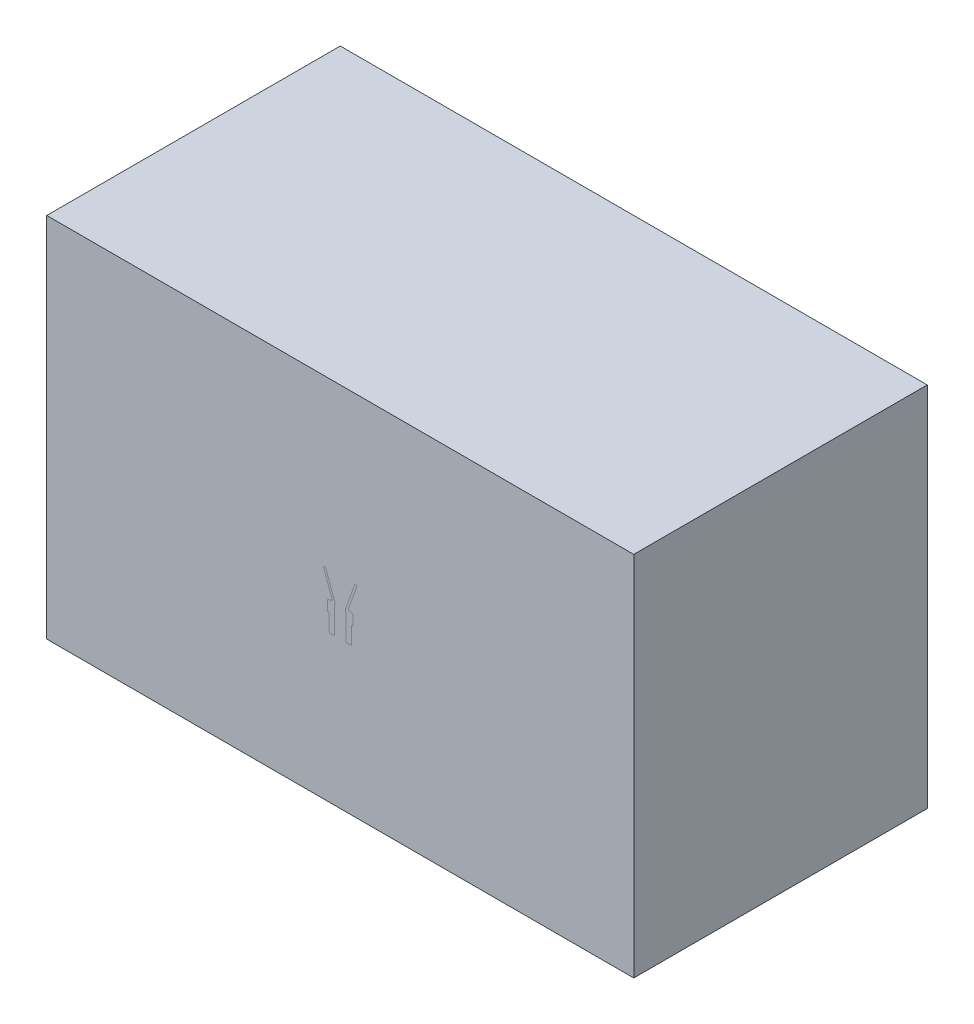
ISO-10303-21;
HEADER;
FILE_DESCRIPTION(('STEP AP214'),'2;1');
FILE_NAME('part.step','',(''),(''),'','','');
FILE_SCHEMA(('AUTOMOTIVE_DESIGN { 1 0 10303 214 1 1 1 1 }'));
ENDSEC;
DATA;
#1=APPLICATION_CONTEXT('core data for automotive mechanical design processes');
#2=APPLICATION_PROTOCOL_DEFINITION('international standard','automotive_design',2000,#1);
#3=PRODUCT_CONTEXT('',#1,'mechanical');
#4=PRODUCT('Part','Part','',(#3));
#5=PRODUCT_RELATED_PRODUCT_CATEGORY('part','',(#4));
#6=PRODUCT_DEFINITION_FORMATION('','',#4);
#7=PRODUCT_DEFINITION_CONTEXT('part definition',#1,'design');
#8=PRODUCT_DEFINITION('design','',#6,#7);
#9=PRODUCT_DEFINITION_SHAPE('','',#8);
#10=(LENGTH_UNIT() NAMED_UNIT(*) SI_UNIT(.MILLI.,.METRE.));
#11=(NAMED_UNIT(*) PLANE_ANGLE_UNIT() SI_UNIT($,.RADIAN.));
#12=(NAMED_UNIT(*) SI_UNIT($,.STERADIAN.) SOLID_ANGLE_UNIT());
#13=UNCERTAINTY_MEASURE_WITH_UNIT(LENGTH_MEASURE(1.E-05),#10,'distance_accuracy_value','');
#14=(GEOMETRIC_REPRESENTATION_CONTEXT(3) GLOBAL_UNCERTAINTY_ASSIGNED_CONTEXT((#13)) GLOBAL_UNIT_ASSIGNED_CONTEXT((#10,
#11,#12)) REPRESENTATION_CONTEXT('',''));
#15=CARTESIAN_POINT('',(0.,0.,0.));
#16=DIRECTION('',(0.,0.,1.));
#17=DIRECTION('',(1.,0.,0.));
#18=AXIS2_PLACEMENT_3D('',#15,#16,#17);
#19=CARTESIAN_POINT('',(0.,941.954291822987,0.));
#20=DIRECTION('',(0.,1.,0.));
#21=DIRECTION('',(0.,0.,1.));
#22=AXIS2_PLACEMENT_3D('',#19,#20,#21);
#23=TOROIDAL_SURFACE('',#22,265.023984913654,12.7);
#24=CARTESIAN_POINT('',(0.,946.297947643223,0.));
#25=DIRECTION('',(0.,-1.,0.));
#26=DIRECTION('',(0.,0.,-1.));
#27=AXIS2_PLACEMENT_3D('',#24,#25,#26);
#28=CIRCLE('',#27,253.089888629673);
#29=CARTESIAN_POINT('',(253.089888629673,946.297947643223,0.));
#30=VERTEX_POINT('',#29);
#31=CARTESIAN_POINT('',(-253.089888629673,946.297947643223,0.));
#32=VERTEX_POINT('',#31);
#33=EDGE_CURVE('E175',#30,#32,#28,.F.);
#34=ORIENTED_EDGE('',*,*,#33,.F.);
#35=CARTESIAN_POINT('',(265.023984913654,941.954291822987,0.));
#36=DIRECTION('',(0.,0.,1.));
#37=DIRECTION('',(1.,0.,0.));
#38=AXIS2_PLACEMENT_3D('',#35,#36,#37);
#39=CIRCLE('',#38,12.7);
#40=CARTESIAN_POINT('',(269.36764073389,953.888388106968,0.));
#41=VERTEX_POINT('',#40);
#42=EDGE_CURVE('E214',#30,#41,#39,.F.);
#43=ORIENTED_EDGE('',*,*,#42,.T.);
#44=CARTESIAN_POINT('',(0.,953.888388106968,0.));
#45=DIRECTION('',(0.,1.,0.));
#46=DIRECTION('',(0.,0.,1.));
#47=AXIS2_PLACEMENT_3D('',#44,#45,#46);
#48=CIRCLE('',#47,269.36764073389);
#49=CARTESIAN_POINT('',(-269.36764073389,953.888388106968,0.));
#50=VERTEX_POINT('',#49);
#51=EDGE_CURVE('E169',#50,#41,#48,.F.);
#52=ORIENTED_EDGE('',*,*,#51,.F.);
#53=CARTESIAN_POINT('',(-265.023984913654,941.954291822987,0.));
#54=DIRECTION('',(0.,0.,1.));
#55=DIRECTION('',(1.,0.,0.));
#56=AXIS2_PLACEMENT_3D('',#53,#54,#55);
#57=CIRCLE('',#56,12.7);
#58=EDGE_CURVE('E177',#50,#32,#57,.F.);
#59=ORIENTED_EDGE('',*,*,#58,.T.);
#60=EDGE_LOOP('',(#34,#43,#52,#59));
#61=FACE_BOUND('',#60,.T.);
#62=ADVANCED_FACE('F53',(#61),#23,.T.);
#63=CARTESIAN_POINT('',(0.,937.610636002752,0.));
#64=DIRECTION('',(0.,1.,0.));
#65=DIRECTION('',(0.,0.,1.));
#66=AXIS2_PLACEMENT_3D('',#63,#64,#65);
#67=TOROIDAL_SURFACE('',#66,276.958081197635,12.7);
#68=CARTESIAN_POINT('',(0.,949.544732286733,0.));
#69=DIRECTION('',(0.,1.,0.));
#70=DIRECTION('',(0.,0.,1.));
#71=AXIS2_PLACEMENT_3D('',#68,#69,#70);
#72=CIRCLE('',#71,281.301737017871);
#73=CARTESIAN_POINT('',(281.301737017871,949.544732286733,0.));
#74=VERTEX_POINT('',#73);
#75=CARTESIAN_POINT('',(-281.301737017871,949.544732286733,0.));
#76=VERTEX_POINT('',#75);
#77=EDGE_CURVE('E172',#74,#76,#72,.T.);
#78=ORIENTED_EDGE('',*,*,#77,.F.);
#79=CARTESIAN_POINT('',(276.958081197635,937.610636002752,0.));
#80=DIRECTION('',(0.,0.,1.));
#81=DIRECTION('',(1.,0.,0.));
#82=AXIS2_PLACEMENT_3D('',#79,#80,#81);
#83=CIRCLE('',#82,12.7);
#84=CARTESIAN_POINT('',(288.892177481616,933.266980182516,0.));
#85=VERTEX_POINT('',#84);
#86=EDGE_CURVE('E242',#74,#85,#83,.F.);
#87=ORIENTED_EDGE('',*,*,#86,.T.);
#88=CARTESIAN_POINT('',(0.,933.266980182516,0.));
#89=DIRECTION('',(0.,-1.,0.));
#90=DIRECTION('',(0.,0.,-1.));
#91=AXIS2_PLACEMENT_3D('',#88,#89,#90);
#92=CIRCLE('',#91,288.892177481616);
#93=CARTESIAN_POINT('',(-288.892177481616,933.266980182516,0.));
#94=VERTEX_POINT('',#93);
#95=EDGE_CURVE('E163',#94,#85,#92,.T.);
#96=ORIENTED_EDGE('',*,*,#95,.F.);
#97=CARTESIAN_POINT('',(-276.958081197635,937.610636002752,0.));
#98=DIRECTION('',(0.,0.,1.));
#99=DIRECTION('',(1.,0.,0.));
#100=AXIS2_PLACEMENT_3D('',#97,#98,#99);
#101=CIRCLE('',#100,12.7);
#102=EDGE_CURVE('E226',#94,#76,#101,.F.);
#103=ORIENTED_EDGE('',*,*,#102,.T.);
#104=EDGE_LOOP('',(#78,#87,#96,#103));
#105=FACE_BOUND('',#104,.T.);
#106=ADVANCED_FACE('F235',(#105),#67,.T.);
#107=CARTESIAN_POINT('',(0.,483.381827876511,0.));
#108=DIRECTION('',(0.,-1.,0.));
#109=DIRECTION('',(0.,0.,-1.));
#110=AXIS2_PLACEMENT_3D('',#107,#108,#109);
#111=TOROIDAL_SURFACE('',#110,138.66243091436,50.8);
#112=CARTESIAN_POINT('',(0.,500.756451157454,0.));
#113=DIRECTION('',(0.,-1.,0.));
#114=DIRECTION('',(0.,0.,-1.));
#115=AXIS2_PLACEMENT_3D('',#112,#113,#114);
#116=CIRCLE('',#115,90.9260457784361);
#117=CARTESIAN_POINT('',(-90.9260457784361,500.756451157454,0.));
#118=VERTEX_POINT('',#117);
#119=CARTESIAN_POINT('',(90.9260457784361,500.756451157454,0.));
#120=VERTEX_POINT('',#119);
#121=EDGE_CURVE('E158',#118,#120,#116,.T.);
#122=ORIENTED_EDGE('',*,*,#121,.F.);
#123=CARTESIAN_POINT('',(-138.66243091436,483.381827876511,0.));
#124=DIRECTION('',(0.,0.,1.));
#125=DIRECTION('',(1.,0.,0.));
#126=AXIS2_PLACEMENT_3D('',#123,#124,#125);
#127=CIRCLE('',#126,50.8);
#128=CARTESIAN_POINT('',(-95.25,457.,0.));
#129=VERTEX_POINT('',#128);
#130=EDGE_CURVE('E224',#118,#129,#127,.F.);
#131=ORIENTED_EDGE('',*,*,#130,.T.);
#132=CARTESIAN_POINT('',(0.,457.,0.));
#133=DIRECTION('',(0.,1.,0.));
#134=DIRECTION('',(0.,0.,1.));
#135=AXIS2_PLACEMENT_3D('',#132,#133,#134);
#136=CIRCLE('',#135,95.25);
#137=CARTESIAN_POINT('',(95.25,457.,0.));
#138=VERTEX_POINT('',#137);
#139=EDGE_CURVE('E197',#138,#129,#136,.T.);
#140=ORIENTED_EDGE('',*,*,#139,.F.);
#141=CARTESIAN_POINT('',(138.66243091436,483.381827876511,0.));
#142=DIRECTION('',(0.,0.,1.));
#143=DIRECTION('',(1.,0.,0.));
#144=AXIS2_PLACEMENT_3D('',#141,#142,#143);
#145=CIRCLE('',#144,50.8);
#146=EDGE_CURVE('E244',#138,#120,#145,.F.);
#147=ORIENTED_EDGE('',*,*,#146,.T.);
#148=EDGE_LOOP('',(#122,#131,#140,#147));
#149=FACE_BOUND('',#148,.T.);
#150=ADVANCED_FACE('F281',(#149),#111,.T.);
#151=CARTESIAN_POINT('',(0.,457.,0.));
#152=DIRECTION('',(0.,1.,0.));
#153=DIRECTION('',(0.,0.,1.));
#154=AXIS2_PLACEMENT_3D('',#151,#152,#153);
#155=CONICAL_SURFACE('',#154,75.,0.349065850398861);
#156=DIRECTION('',(0.342020143325664,0.93969262078591,0.));
#157=VECTOR('',#156,1.);
#158=CARTESIAN_POINT('',(0.,250.9391935409,0.));
#159=LINE('',#158,#157);
#160=EDGE_CURVE('E241',#30,#120,#159,.F.);
#161=ORIENTED_EDGE('',*,*,#160,.F.);
#162=ORIENTED_EDGE('',*,*,#33,.T.);
#163=DIRECTION('',(0.342020143325664,-0.93969262078591,0.));
#164=VECTOR('',#163,1.);
#165=CARTESIAN_POINT('',(0.,250.9391935409,0.));
#166=LINE('',#165,#164);
#167=EDGE_CURVE('E183',#118,#32,#166,.F.);
#168=ORIENTED_EDGE('',*,*,#167,.F.);
#169=ORIENTED_EDGE('',*,*,#121,.T.);
#170=EDGE_LOOP('',(#161,#162,#168,#169));
#171=FACE_BOUND('',#170,.T.);
#172=ADVANCED_FACE('F273',(#171),#155,.F.);
#173=CARTESIAN_POINT('',(0.,958.232043927204,0.));
#174=DIRECTION('',(0.,-1.,0.));
#175=DIRECTION('',(0.,0.,-1.));
#176=AXIS2_PLACEMENT_3D('',#173,#174,#175);
#177=CONICAL_SURFACE('',#176,257.433544449909,1.22173047639604);
#178=DIRECTION('',(-0.93969262078591,-0.342020143325664,0.));
#179=VECTOR('',#178,1.);
#180=CARTESIAN_POINT('',(0.,1051.93019140862,0.));
#181=LINE('',#180,#179);
#182=EDGE_CURVE('E187',#50,#76,#181,.T.);
#183=ORIENTED_EDGE('',*,*,#182,.F.);
#184=ORIENTED_EDGE('',*,*,#51,.T.);
#185=DIRECTION('',(-0.93969262078591,0.342020143325664,0.));
#186=VECTOR('',#185,1.);
#187=CARTESIAN_POINT('',(0.,1051.93019140862,0.));
#188=LINE('',#187,#186);
#189=EDGE_CURVE('E239',#74,#41,#188,.T.);
#190=ORIENTED_EDGE('',*,*,#189,.F.);
#191=ORIENTED_EDGE('',*,*,#77,.T.);
#192=EDGE_LOOP('',(#183,#184,#190,#191));
#193=FACE_BOUND('',#192,.T.);
#194=ADVANCED_FACE('F238',(#193),#177,.T.);
#195=CARTESIAN_POINT('',(0.,945.201076466497,0.));
#196=DIRECTION('',(0.,1.,0.));
#197=DIRECTION('',(0.,0.,1.));
#198=AXIS2_PLACEMENT_3D('',#195,#196,#197);
#199=CONICAL_SURFACE('',#198,293.235833301852,0.34906585039886);
#200=DIRECTION('',(0.342020143325663,0.93969262078591,0.));
#201=VECTOR('',#200,1.);
#202=CARTESIAN_POINT('',(0.,139.542245894684,0.));
#203=LINE('',#202,#201);
#204=CARTESIAN_POINT('',(136.003504924822,513.208804642325,0.));
#205=VERTEX_POINT('',#204);
#206=EDGE_CURVE('E249',#205,#85,#203,.T.);
#207=ORIENTED_EDGE('',*,*,#206,.F.);
#208=CARTESIAN_POINT('',(0.,513.208804642325,0.));
#209=DIRECTION('',(0.,-1.,0.));
#210=DIRECTION('',(0.,0.,-1.));
#211=AXIS2_PLACEMENT_3D('',#208,#209,#210);
#212=CIRCLE('',#211,136.003504924822);
#213=CARTESIAN_POINT('',(-136.003504924822,513.208804642325,0.));
#214=VERTEX_POINT('',#213);
#215=EDGE_CURVE('E146',#214,#205,#212,.T.);
#216=ORIENTED_EDGE('',*,*,#215,.F.);
#217=DIRECTION('',(0.342020143325663,-0.93969262078591,0.));
#218=VECTOR('',#217,1.);
#219=CARTESIAN_POINT('',(0.,139.542245894684,0.));
#220=LINE('',#219,#218);
#221=EDGE_CURVE('E222',#94,#214,#220,.T.);
#222=ORIENTED_EDGE('',*,*,#221,.F.);
#223=ORIENTED_EDGE('',*,*,#95,.T.);
#224=EDGE_LOOP('',(#207,#216,#222,#223));
#225=FACE_BOUND('',#224,.T.);
#226=ADVANCED_FACE('F265',(#225),#199,.T.);
#227=CARTESIAN_POINT('',(0.,513.208804642325,0.));
#228=DIRECTION('',(0.,-1.,0.));
#229=DIRECTION('',(0.,0.,-1.));
#230=AXIS2_PLACEMENT_3D('',#227,#228,#229);
#231=CONICAL_SURFACE('',#230,136.003504924822,1.22173047639604);
#232=DIRECTION('',(-0.93969262078591,-0.342020143325664,0.));
#233=VECTOR('',#232,1.);
#234=CARTESIAN_POINT('',(0.,562.710032190836,0.));
#235=LINE('',#234,#233);
#236=CARTESIAN_POINT('',(-220.65,482.4,0.));
#237=VERTEX_POINT('',#236);
#238=EDGE_CURVE('E220',#214,#237,#235,.T.);
#239=ORIENTED_EDGE('',*,*,#238,.F.);
#240=ORIENTED_EDGE('',*,*,#215,.T.);
#241=DIRECTION('',(-0.93969262078591,0.342020143325664,0.));
#242=VECTOR('',#241,1.);
#243=CARTESIAN_POINT('',(0.,562.710032190836,0.));
#244=LINE('',#243,#242);
#245=CARTESIAN_POINT('',(220.65,482.4,0.));
#246=VERTEX_POINT('',#245);
#247=EDGE_CURVE('E251',#246,#205,#244,.T.);
#248=ORIENTED_EDGE('',*,*,#247,.F.);
#249=CARTESIAN_POINT('',(0.,482.4,0.));
#250=DIRECTION('',(0.,-1.,0.));
#251=DIRECTION('',(0.,0.,-1.));
#252=AXIS2_PLACEMENT_3D('',#249,#250,#251);
#253=CIRCLE('',#252,220.65);
#254=EDGE_CURVE('E193',#237,#246,#253,.T.);
#255=ORIENTED_EDGE('',*,*,#254,.F.);
#256=EDGE_LOOP('',(#239,#240,#248,#255));
#257=FACE_BOUND('',#256,.T.);
#258=ADVANCED_FACE('F260',(#257),#231,.T.);
#259=CARTESIAN_POINT('',(0.,0.,0.));
#260=DIRECTION('',(0.,-1.,0.));
#261=DIRECTION('',(0.,0.,-1.));
#262=AXIS2_PLACEMENT_3D('',#259,#260,#261);
#263=CYLINDRICAL_SURFACE('',#262,220.65);
#264=DIRECTION('',(0.,-1.,0.));
#265=VECTOR('',#264,1.);
#266=CARTESIAN_POINT('',(-220.65,0.,0.));
#267=LINE('',#266,#265);
#268=CARTESIAN_POINT('',(-220.65,307.,0.));
#269=VERTEX_POINT('',#268);
#270=EDGE_CURVE('E213',#237,#269,#267,.T.);
#271=ORIENTED_EDGE('',*,*,#270,.F.);
#272=ORIENTED_EDGE('',*,*,#254,.T.);
#273=DIRECTION('',(0.,-1.,0.));
#274=VECTOR('',#273,1.);
#275=CARTESIAN_POINT('',(220.65,0.,0.));
#276=LINE('',#275,#274);
#277=CARTESIAN_POINT('',(220.65,307.,0.));
#278=VERTEX_POINT('',#277);
#279=EDGE_CURVE('E153',#278,#246,#276,.F.);
#280=ORIENTED_EDGE('',*,*,#279,.F.);
#281=CARTESIAN_POINT('',(0.,307.,0.));
#282=DIRECTION('',(0.,-1.,0.));
#283=DIRECTION('',(0.,0.,-1.));
#284=AXIS2_PLACEMENT_3D('',#281,#282,#283);
#285=CIRCLE('',#284,220.65);
#286=EDGE_CURVE('E152',#269,#278,#285,.T.);
#287=ORIENTED_EDGE('',*,*,#286,.F.);
#288=EDGE_LOOP('',(#271,#272,#280,#287));
#289=FACE_BOUND('',#288,.T.);
#290=ADVANCED_FACE('F263',(#289),#263,.T.);
#291=CARTESIAN_POINT('',(-195.25,307.,0.));
#292=DIRECTION('',(0.,1.,0.));
#293=DIRECTION('',(0.,0.,1.));
#294=AXIS2_PLACEMENT_3D('',#291,#292,#293);
#295=PLANE('',#294);
#296=DIRECTION('',(1.,0.,0.));
#297=VECTOR('',#296,1.);
#298=CARTESIAN_POINT('',(-195.25,307.,0.));
#299=LINE('',#298,#297);
#300=CARTESIAN_POINT('',(-195.25,307.,0.));
#301=VERTEX_POINT('',#300);
#302=EDGE_CURVE('E75',#269,#301,#299,.T.);
#303=ORIENTED_EDGE('',*,*,#302,.F.);
#304=ORIENTED_EDGE('',*,*,#286,.T.);
#305=CARTESIAN_POINT('',(195.25,307.,0.));
#306=VERTEX_POINT('',#305);
#307=EDGE_CURVE('E140',#306,#278,#299,.T.);
#308=ORIENTED_EDGE('',*,*,#307,.F.);
#309=CARTESIAN_POINT('',(0.,307.,0.));
#310=DIRECTION('',(0.,1.,0.));
#311=DIRECTION('',(0.,0.,1.));
#312=AXIS2_PLACEMENT_3D('',#309,#310,#311);
#313=CIRCLE('',#312,195.25);
#314=EDGE_CURVE('E150',#306,#301,#313,.T.);
#315=ORIENTED_EDGE('',*,*,#314,.T.);
#316=EDGE_LOOP('',(#303,#304,#308,#315));
#317=FACE_BOUND('',#316,.T.);
#318=ADVANCED_FACE('F55',(#317),#295,.F.);
#319=CARTESIAN_POINT('',(0.,457.,0.));
#320=DIRECTION('',(0.,-1.,0.));
#321=DIRECTION('',(0.,0.,-1.));
#322=AXIS2_PLACEMENT_3D('',#319,#320,#321);
#323=CYLINDRICAL_SURFACE('',#322,95.25);
#324=ORIENTED_EDGE('',*,*,#139,.T.);
#325=DIRECTION('',(0.,-1.,0.));
#326=VECTOR('',#325,1.);
#327=CARTESIAN_POINT('',(-95.25,457.,0.));
#328=LINE('',#327,#326);
#329=CARTESIAN_POINT('',(-95.25,0.,0.));
#330=VERTEX_POINT('',#329);
#331=EDGE_CURVE('E210',#129,#330,#328,.T.);
#332=ORIENTED_EDGE('',*,*,#331,.T.);
#333=CARTESIAN_POINT('',(0.,0.,0.));
#334=DIRECTION('',(0.,1.,0.));
#335=DIRECTION('',(0.,0.,1.));
#336=AXIS2_PLACEMENT_3D('',#333,#334,#335);
#337=CIRCLE('',#336,95.25);
#338=CARTESIAN_POINT('',(95.25,0.,0.));
#339=VERTEX_POINT('',#338);
#340=EDGE_CURVE('E160',#339,#330,#337,.T.);
#341=ORIENTED_EDGE('',*,*,#340,.F.);
#342=DIRECTION('',(0.,-1.,0.));
#343=VECTOR('',#342,1.);
#344=CARTESIAN_POINT('',(95.25,457.,0.));
#345=LINE('',#344,#343);
#346=EDGE_CURVE('E154',#339,#138,#345,.F.);
#347=ORIENTED_EDGE('',*,*,#346,.T.);
#348=EDGE_LOOP('',(#324,#332,#341,#347));
#349=FACE_BOUND('',#348,.T.);
#350=ADVANCED_FACE('F208',(#349),#323,.F.);
#351=CARTESIAN_POINT('',(0.,0.,0.));
#352=DIRECTION('',(0.,1.,0.));
#353=DIRECTION('',(0.,0.,1.));
#354=AXIS2_PLACEMENT_3D('',#351,#352,#353);
#355=PLANE('',#354);
#356=DIRECTION('',(1.,0.,0.));
#357=VECTOR('',#356,1.);
#358=CARTESIAN_POINT('',(0.,0.,0.));
#359=LINE('',#358,#357);
#360=CARTESIAN_POINT('',(-195.25,0.,0.));
#361=VERTEX_POINT('',#360);
#362=EDGE_CURVE('E204',#361,#330,#359,.T.);
#363=ORIENTED_EDGE('',*,*,#362,.F.);
#364=CARTESIAN_POINT('',(0.,0.,0.));
#365=DIRECTION('',(0.,1.,0.));
#366=DIRECTION('',(0.,0.,1.));
#367=AXIS2_PLACEMENT_3D('',#364,#365,#366);
#368=CIRCLE('',#367,195.25);
#369=CARTESIAN_POINT('',(195.25,0.,0.));
#370=VERTEX_POINT('',#369);
#371=EDGE_CURVE('E157',#370,#361,#368,.T.);
#372=ORIENTED_EDGE('',*,*,#371,.F.);
#373=EDGE_CURVE('E68',#339,#370,#359,.T.);
#374=ORIENTED_EDGE('',*,*,#373,.F.);
#375=ORIENTED_EDGE('',*,*,#340,.T.);
#376=EDGE_LOOP('',(#363,#372,#374,#375));
#377=FACE_BOUND('',#376,.T.);
#378=ADVANCED_FACE('F203',(#377),#355,.F.);
#379=CARTESIAN_POINT('',(0.,457.,0.));
#380=DIRECTION('',(0.,-1.,0.));
#381=DIRECTION('',(0.,0.,-1.));
#382=AXIS2_PLACEMENT_3D('',#379,#380,#381);
#383=CYLINDRICAL_SURFACE('',#382,195.25);
#384=DIRECTION('',(0.,-1.,0.));
#385=VECTOR('',#384,1.);
#386=CARTESIAN_POINT('',(-195.25,457.,0.));
#387=LINE('',#386,#385);
#388=EDGE_CURVE('E12',#301,#361,#387,.T.);
#389=ORIENTED_EDGE('',*,*,#388,.F.);
#390=ORIENTED_EDGE('',*,*,#314,.F.);
#391=DIRECTION('',(0.,-1.,0.));
#392=VECTOR('',#391,1.);
#393=CARTESIAN_POINT('',(195.25,457.,0.));
#394=LINE('',#393,#392);
#395=EDGE_CURVE('E61',#370,#306,#394,.F.);
#396=ORIENTED_EDGE('',*,*,#395,.F.);
#397=ORIENTED_EDGE('',*,*,#371,.T.);
#398=EDGE_LOOP('',(#389,#390,#396,#397));
#399=FACE_BOUND('',#398,.T.);
#400=ADVANCED_FACE('F156',(#399),#383,.T.);
#401=CARTESIAN_POINT('',(0.,0.,0.));
#402=DIRECTION('',(0.,0.,1.));
#403=DIRECTION('',(1.,0.,0.));
#404=AXIS2_PLACEMENT_3D('',#401,#402,#403);
#405=PLANE('',#404);
#406=ORIENTED_EDGE('',*,*,#160,.T.);
#407=ORIENTED_EDGE('',*,*,#146,.F.);
#408=ORIENTED_EDGE('',*,*,#346,.F.);
#409=ORIENTED_EDGE('',*,*,#373,.T.);
#410=ORIENTED_EDGE('',*,*,#395,.T.);
#411=ORIENTED_EDGE('',*,*,#307,.T.);
#412=ORIENTED_EDGE('',*,*,#279,.T.);
#413=ORIENTED_EDGE('',*,*,#247,.T.);
#414=ORIENTED_EDGE('',*,*,#206,.T.);
#415=ORIENTED_EDGE('',*,*,#86,.F.);
#416=ORIENTED_EDGE('',*,*,#189,.T.);
#417=ORIENTED_EDGE('',*,*,#42,.F.);
#418=EDGE_LOOP('',(#406,#407,#408,#409,#410,#411,#412,#413,#414,#415,#416,#417));
#419=FACE_BOUND('',#418,.T.);
#420=ADVANCED_FACE('F139',(#419),#405,.T.);
#421=ORIENTED_EDGE('',*,*,#182,.T.);
#422=ORIENTED_EDGE('',*,*,#102,.F.);
#423=ORIENTED_EDGE('',*,*,#221,.T.);
#424=ORIENTED_EDGE('',*,*,#238,.T.);
#425=ORIENTED_EDGE('',*,*,#270,.T.);
#426=ORIENTED_EDGE('',*,*,#302,.T.);
#427=ORIENTED_EDGE('',*,*,#388,.T.);
#428=ORIENTED_EDGE('',*,*,#362,.T.);
#429=ORIENTED_EDGE('',*,*,#331,.F.);
#430=ORIENTED_EDGE('',*,*,#130,.F.);
#431=ORIENTED_EDGE('',*,*,#167,.T.);
#432=ORIENTED_EDGE('',*,*,#58,.F.);
#433=EDGE_LOOP('',(#421,#422,#423,#424,#425,#426,#427,#428,#429,#430,#431,#432));
#434=FACE_BOUND('',#433,.T.);
#435=ADVANCED_FACE('F229',(#434),#405,.T.);
#436=CLOSED_SHELL('',(#62,#106,#150,#172,#194,#226,#258,#290,#318,#350,#378,#400,#420,#435));
#437=MANIFOLD_SOLID_BREP('B2',#436);
#438=CARTESIAN_POINT('',(0.,941.954291822987,0.));
#439=DIRECTION('',(0.,1.,0.));
#440=DIRECTION('',(0.,0.,1.));
#441=AXIS2_PLACEMENT_3D('',#438,#439,#440);
#442=TOROIDAL_SURFACE('',#441,265.023984913654,12.7);
#443=CARTESIAN_POINT('',(265.023984913654,941.954291822987,0.));
#444=DIRECTION('',(0.,0.,1.));
#445=DIRECTION('',(1.,0.,0.));
#446=AXIS2_PLACEMENT_3D('',#443,#444,#445);
#447=CIRCLE('',#446,12.7);
#448=CARTESIAN_POINT('',(253.089888629673,946.297947643223,0.));
#449=VERTEX_POINT('',#448);
#450=CARTESIAN_POINT('',(269.36764073389,953.888388106968,0.));
#451=VERTEX_POINT('',#450);
#452=EDGE_CURVE('E627',#449,#451,#447,.F.);
#453=ORIENTED_EDGE('',*,*,#452,.F.);
#454=CARTESIAN_POINT('',(0.,946.297947643223,0.));
#455=DIRECTION('',(0.,-1.,0.));
#456=DIRECTION('',(0.,0.,-1.));
#457=AXIS2_PLACEMENT_3D('',#454,#455,#456);
#458=CIRCLE('',#457,253.089888629673);
#459=CARTESIAN_POINT('',(-253.089888629673,946.297947643223,0.));
#460=VERTEX_POINT('',#459);
#461=EDGE_CURVE('E573',#449,#460,#458,.F.);
#462=ORIENTED_EDGE('',*,*,#461,.T.);
#463=CARTESIAN_POINT('',(-265.023984913654,941.954291822987,0.));
#464=DIRECTION('',(0.,0.,1.));
#465=DIRECTION('',(1.,0.,0.));
#466=AXIS2_PLACEMENT_3D('',#463,#464,#465);
#467=CIRCLE('',#466,12.7);
#468=CARTESIAN_POINT('',(-269.36764073389,953.888388106968,0.));
#469=VERTEX_POINT('',#468);
#470=EDGE_CURVE('E655',#469,#460,#467,.F.);
#471=ORIENTED_EDGE('',*,*,#470,.F.);
#472=CARTESIAN_POINT('',(0.,953.888388106968,0.));
#473=DIRECTION('',(0.,1.,0.));
#474=DIRECTION('',(0.,0.,1.));
#475=AXIS2_PLACEMENT_3D('',#472,#473,#474);
#476=CIRCLE('',#475,269.36764073389);
#477=EDGE_CURVE('E565',#469,#451,#476,.F.);
#478=ORIENTED_EDGE('',*,*,#477,.T.);
#479=EDGE_LOOP('',(#453,#462,#471,#478));
#480=FACE_BOUND('',#479,.T.);
#481=ADVANCED_FACE('F413',(#480),#442,.F.);
#482=CARTESIAN_POINT('',(0.,937.610636002752,0.));
#483=DIRECTION('',(0.,1.,0.));
#484=DIRECTION('',(0.,0.,1.));
#485=AXIS2_PLACEMENT_3D('',#482,#483,#484);
#486=TOROIDAL_SURFACE('',#485,276.958081197635,12.7);
#487=CARTESIAN_POINT('',(276.958081197635,937.610636002752,0.));
#488=DIRECTION('',(0.,0.,1.));
#489=DIRECTION('',(1.,0.,0.));
#490=AXIS2_PLACEMENT_3D('',#487,#488,#489);
#491=CIRCLE('',#490,12.7);
#492=CARTESIAN_POINT('',(281.301737017871,949.544732286733,0.));
#493=VERTEX_POINT('',#492);
#494=CARTESIAN_POINT('',(288.892177481616,933.266980182516,0.));
#495=VERTEX_POINT('',#494);
#496=EDGE_CURVE('E729',#493,#495,#491,.F.);
#497=ORIENTED_EDGE('',*,*,#496,.F.);
#498=CARTESIAN_POINT('',(0.,949.544732286733,0.));
#499=DIRECTION('',(0.,1.,0.));
#500=DIRECTION('',(0.,0.,1.));
#501=AXIS2_PLACEMENT_3D('',#498,#499,#500);
#502=CIRCLE('',#501,281.301737017871);
#503=CARTESIAN_POINT('',(-281.301737017871,949.544732286733,0.));
#504=VERTEX_POINT('',#503);
#505=EDGE_CURVE('E569',#493,#504,#502,.T.);
#506=ORIENTED_EDGE('',*,*,#505,.T.);
#507=CARTESIAN_POINT('',(-276.958081197635,937.610636002752,0.));
#508=DIRECTION('',(0.,0.,1.));
#509=DIRECTION('',(1.,0.,0.));
#510=AXIS2_PLACEMENT_3D('',#507,#508,#509);
#511=CIRCLE('',#510,12.7);
#512=CARTESIAN_POINT('',(-288.892177481616,933.266980182516,0.));
#513=VERTEX_POINT('',#512);
#514=EDGE_CURVE('E644',#513,#504,#511,.F.);
#515=ORIENTED_EDGE('',*,*,#514,.F.);
#516=CARTESIAN_POINT('',(0.,933.266980182516,0.));
#517=DIRECTION('',(0.,-1.,0.));
#518=DIRECTION('',(0.,0.,-1.));
#519=AXIS2_PLACEMENT_3D('',#516,#517,#518);
#520=CIRCLE('',#519,288.892177481616);
#521=EDGE_CURVE('E561',#513,#495,#520,.T.);
#522=ORIENTED_EDGE('',*,*,#521,.T.);
#523=EDGE_LOOP('',(#497,#506,#515,#522));
#524=FACE_BOUND('',#523,.T.);
#525=ADVANCED_FACE('F711',(#524),#486,.F.);
#526=CARTESIAN_POINT('',(0.,483.381827876511,0.));
#527=DIRECTION('',(0.,-1.,0.));
#528=DIRECTION('',(0.,0.,-1.));
#529=AXIS2_PLACEMENT_3D('',#526,#527,#528);
#530=TOROIDAL_SURFACE('',#529,138.66243091436,50.8);
#531=CARTESIAN_POINT('',(-138.66243091436,483.381827876511,0.));
#532=DIRECTION('',(0.,0.,1.));
#533=DIRECTION('',(1.,0.,0.));
#534=AXIS2_PLACEMENT_3D('',#531,#532,#533);
#535=CIRCLE('',#534,50.8);
#536=CARTESIAN_POINT('',(-90.9260457784361,500.756451157454,0.));
#537=VERTEX_POINT('',#536);
#538=CARTESIAN_POINT('',(-95.25,457.,0.));
#539=VERTEX_POINT('',#538);
#540=EDGE_CURVE('E612',#537,#539,#535,.F.);
#541=ORIENTED_EDGE('',*,*,#540,.F.);
#542=CARTESIAN_POINT('',(0.,500.756451157454,0.));
#543=DIRECTION('',(0.,-1.,0.));
#544=DIRECTION('',(0.,0.,-1.));
#545=AXIS2_PLACEMENT_3D('',#542,#543,#544);
#546=CIRCLE('',#545,90.9260457784361);
#547=CARTESIAN_POINT('',(90.9260457784361,500.756451157454,0.));
#548=VERTEX_POINT('',#547);
#549=EDGE_CURVE('E554',#537,#548,#546,.T.);
#550=ORIENTED_EDGE('',*,*,#549,.T.);
#551=CARTESIAN_POINT('',(138.66243091436,483.381827876511,0.));
#552=DIRECTION('',(0.,0.,1.));
#553=DIRECTION('',(1.,0.,0.));
#554=AXIS2_PLACEMENT_3D('',#551,#552,#553);
#555=CIRCLE('',#554,50.8);
#556=CARTESIAN_POINT('',(95.25,457.,0.));
#557=VERTEX_POINT('',#556);
#558=EDGE_CURVE('E614',#557,#548,#555,.F.);
#559=ORIENTED_EDGE('',*,*,#558,.F.);
#560=CARTESIAN_POINT('',(0.,457.,0.));
#561=DIRECTION('',(0.,1.,0.));
#562=DIRECTION('',(0.,0.,1.));
#563=AXIS2_PLACEMENT_3D('',#560,#561,#562);
#564=CIRCLE('',#563,95.25);
#565=EDGE_CURVE('E552',#557,#539,#564,.T.);
#566=ORIENTED_EDGE('',*,*,#565,.T.);
#567=EDGE_LOOP('',(#541,#550,#559,#566));
#568=FACE_BOUND('',#567,.T.);
#569=ADVANCED_FACE('F611',(#568),#530,.F.);
#570=CARTESIAN_POINT('',(0.,457.,0.));
#571=DIRECTION('',(0.,1.,0.));
#572=DIRECTION('',(0.,0.,1.));
#573=AXIS2_PLACEMENT_3D('',#570,#571,#572);
#574=CONICAL_SURFACE('',#573,75.,0.349065850398861);
#575=ORIENTED_EDGE('',*,*,#461,.F.);
#576=DIRECTION('',(0.342020143325664,0.93969262078591,0.));
#577=VECTOR('',#576,1.);
#578=CARTESIAN_POINT('',(0.,250.9391935409,0.));
#579=LINE('',#578,#577);
#580=EDGE_CURVE('E719',#449,#548,#579,.F.);
#581=ORIENTED_EDGE('',*,*,#580,.T.);
#582=ORIENTED_EDGE('',*,*,#549,.F.);
#583=DIRECTION('',(0.342020143325664,-0.93969262078591,0.));
#584=VECTOR('',#583,1.);
#585=CARTESIAN_POINT('',(0.,250.9391935409,0.));
#586=LINE('',#585,#584);
#587=EDGE_CURVE('E651',#537,#460,#586,.F.);
#588=ORIENTED_EDGE('',*,*,#587,.T.);
#589=EDGE_LOOP('',(#575,#581,#582,#588));
#590=FACE_BOUND('',#589,.T.);
#591=ADVANCED_FACE('F722',(#590),#574,.T.);
#592=CARTESIAN_POINT('',(0.,958.232043927204,0.));
#593=DIRECTION('',(0.,-1.,0.));
#594=DIRECTION('',(0.,0.,-1.));
#595=AXIS2_PLACEMENT_3D('',#592,#593,#594);
#596=CONICAL_SURFACE('',#595,257.433544449909,1.22173047639604);
#597=ORIENTED_EDGE('',*,*,#477,.F.);
#598=DIRECTION('',(-0.93969262078591,-0.342020143325664,0.));
#599=VECTOR('',#598,1.);
#600=CARTESIAN_POINT('',(0.,1051.93019140862,0.));
#601=LINE('',#600,#599);
#602=EDGE_CURVE('E647',#469,#504,#601,.T.);
#603=ORIENTED_EDGE('',*,*,#602,.T.);
#604=ORIENTED_EDGE('',*,*,#505,.F.);
#605=DIRECTION('',(-0.93969262078591,0.342020143325664,0.));
#606=VECTOR('',#605,1.);
#607=CARTESIAN_POINT('',(0.,1051.93019140862,0.));
#608=LINE('',#607,#606);
#609=EDGE_CURVE('E726',#493,#451,#608,.T.);
#610=ORIENTED_EDGE('',*,*,#609,.T.);
#611=EDGE_LOOP('',(#597,#603,#604,#610));
#612=FACE_BOUND('',#611,.T.);
#613=ADVANCED_FACE('F724',(#612),#596,.F.);
#614=CARTESIAN_POINT('',(0.,945.201076466497,0.));
#615=DIRECTION('',(0.,1.,0.));
#616=DIRECTION('',(0.,0.,1.));
#617=AXIS2_PLACEMENT_3D('',#614,#615,#616);
#618=CONICAL_SURFACE('',#617,293.235833301852,0.34906585039886);
#619=CARTESIAN_POINT('',(0.,513.208804642325,0.));
#620=DIRECTION('',(0.,-1.,0.));
#621=DIRECTION('',(0.,0.,-1.));
#622=AXIS2_PLACEMENT_3D('',#619,#620,#621);
#623=CIRCLE('',#622,136.003504924822);
#624=CARTESIAN_POINT('',(-136.003504924822,513.208804642325,0.));
#625=VERTEX_POINT('',#624);
#626=CARTESIAN_POINT('',(136.003504924822,513.208804642325,0.));
#627=VERTEX_POINT('',#626);
#628=EDGE_CURVE('E533',#625,#627,#623,.T.);
#629=ORIENTED_EDGE('',*,*,#628,.T.);
#630=DIRECTION('',(0.342020143325663,0.93969262078591,0.));
#631=VECTOR('',#630,1.);
#632=CARTESIAN_POINT('',(0.,139.542245894684,0.));
#633=LINE('',#632,#631);
#634=EDGE_CURVE('E737',#627,#495,#633,.T.);
#635=ORIENTED_EDGE('',*,*,#634,.T.);
#636=ORIENTED_EDGE('',*,*,#521,.F.);
#637=DIRECTION('',(0.342020143325663,-0.93969262078591,0.));
#638=VECTOR('',#637,1.);
#639=CARTESIAN_POINT('',(0.,139.542245894684,0.));
#640=LINE('',#639,#638);
#641=EDGE_CURVE('E638',#513,#625,#640,.T.);
#642=ORIENTED_EDGE('',*,*,#641,.T.);
#643=EDGE_LOOP('',(#629,#635,#636,#642));
#644=FACE_BOUND('',#643,.T.);
#645=ADVANCED_FACE('F761',(#644),#618,.F.);
#646=CARTESIAN_POINT('',(0.,513.208804642325,0.));
#647=DIRECTION('',(0.,-1.,0.));
#648=DIRECTION('',(0.,0.,-1.));
#649=AXIS2_PLACEMENT_3D('',#646,#647,#648);
#650=CONICAL_SURFACE('',#649,136.003504924822,1.22173047639604);
#651=ORIENTED_EDGE('',*,*,#628,.F.);
#652=DIRECTION('',(-0.93969262078591,-0.342020143325664,0.));
#653=VECTOR('',#652,1.);
#654=CARTESIAN_POINT('',(0.,562.710032190836,0.));
#655=LINE('',#654,#653);
#656=CARTESIAN_POINT('',(-220.65,482.4,0.));
#657=VERTEX_POINT('',#656);
#658=EDGE_CURVE('E634',#625,#657,#655,.T.);
#659=ORIENTED_EDGE('',*,*,#658,.T.);
#660=CARTESIAN_POINT('',(0.,482.4,0.));
#661=DIRECTION('',(0.,-1.,0.));
#662=DIRECTION('',(0.,0.,-1.));
#663=AXIS2_PLACEMENT_3D('',#660,#661,#662);
#664=CIRCLE('',#663,220.65);
#665=CARTESIAN_POINT('',(220.65,482.4,0.));
#666=VERTEX_POINT('',#665);
#667=EDGE_CURVE('E598',#657,#666,#664,.T.);
#668=ORIENTED_EDGE('',*,*,#667,.T.);
#669=DIRECTION('',(-0.93969262078591,0.342020143325664,0.));
#670=VECTOR('',#669,1.);
#671=CARTESIAN_POINT('',(0.,562.710032190836,0.));
#672=LINE('',#671,#670);
#673=EDGE_CURVE('E741',#666,#627,#672,.T.);
#674=ORIENTED_EDGE('',*,*,#673,.T.);
#675=EDGE_LOOP('',(#651,#659,#668,#674));
#676=FACE_BOUND('',#675,.T.);
#677=ADVANCED_FACE('F759',(#676),#650,.F.);
#678=CARTESIAN_POINT('',(0.,0.,0.));
#679=DIRECTION('',(0.,-1.,0.));
#680=DIRECTION('',(0.,0.,-1.));
#681=AXIS2_PLACEMENT_3D('',#678,#679,#680);
#682=CYLINDRICAL_SURFACE('',#681,220.65);
#683=ORIENTED_EDGE('',*,*,#667,.F.);
#684=DIRECTION('',(0.,-1.,0.));
#685=VECTOR('',#684,1.);
#686=CARTESIAN_POINT('',(-220.65,0.,0.));
#687=LINE('',#686,#685);
#688=CARTESIAN_POINT('',(-220.65,307.,0.));
#689=VERTEX_POINT('',#688);
#690=EDGE_CURVE('E625',#657,#689,#687,.T.);
#691=ORIENTED_EDGE('',*,*,#690,.T.);
#692=CARTESIAN_POINT('',(0.,307.,0.));
#693=DIRECTION('',(0.,-1.,0.));
#694=DIRECTION('',(0.,0.,-1.));
#695=AXIS2_PLACEMENT_3D('',#692,#693,#694);
#696=CIRCLE('',#695,220.65);
#697=CARTESIAN_POINT('',(220.65,307.,0.));
#698=VERTEX_POINT('',#697);
#699=EDGE_CURVE('E602',#689,#698,#696,.T.);
#700=ORIENTED_EDGE('',*,*,#699,.T.);
#701=DIRECTION('',(0.,-1.,0.));
#702=VECTOR('',#701,1.);
#703=CARTESIAN_POINT('',(220.65,0.,0.));
#704=LINE('',#703,#702);
#705=EDGE_CURVE('E745',#698,#666,#704,.F.);
#706=ORIENTED_EDGE('',*,*,#705,.T.);
#707=EDGE_LOOP('',(#683,#691,#700,#706));
#708=FACE_BOUND('',#707,.T.);
#709=ADVANCED_FACE('F756',(#708),#682,.F.);
#710=CARTESIAN_POINT('',(-195.25,307.,0.));
#711=DIRECTION('',(0.,1.,0.));
#712=DIRECTION('',(0.,0.,1.));
#713=AXIS2_PLACEMENT_3D('',#710,#711,#712);
#714=PLANE('',#713);
#715=ORIENTED_EDGE('',*,*,#699,.F.);
#716=DIRECTION('',(1.,0.,0.));
#717=VECTOR('',#716,1.);
#718=CARTESIAN_POINT('',(-195.25,307.,0.));
#719=LINE('',#718,#717);
#720=CARTESIAN_POINT('',(-195.25,307.,0.));
#721=VERTEX_POINT('',#720);
#722=EDGE_CURVE('E620',#689,#721,#719,.T.);
#723=ORIENTED_EDGE('',*,*,#722,.T.);
#724=CARTESIAN_POINT('',(0.,307.,0.));
#725=DIRECTION('',(0.,1.,0.));
#726=DIRECTION('',(0.,0.,1.));
#727=AXIS2_PLACEMENT_3D('',#724,#725,#726);
#728=CIRCLE('',#727,195.25);
#729=CARTESIAN_POINT('',(195.25,307.,0.));
#730=VERTEX_POINT('',#729);
#731=EDGE_CURVE('E548',#730,#721,#728,.T.);
#732=ORIENTED_EDGE('',*,*,#731,.F.);
#733=EDGE_CURVE('E436',#730,#698,#719,.T.);
#734=ORIENTED_EDGE('',*,*,#733,.T.);
#735=EDGE_LOOP('',(#715,#723,#732,#734));
#736=FACE_BOUND('',#735,.T.);
#737=ADVANCED_FACE('F753',(#736),#714,.T.);
#738=CARTESIAN_POINT('',(0.,457.,0.));
#739=DIRECTION('',(0.,-1.,0.));
#740=DIRECTION('',(0.,0.,-1.));
#741=AXIS2_PLACEMENT_3D('',#738,#739,#740);
#742=CYLINDRICAL_SURFACE('',#741,95.25);
#743=DIRECTION('',(0.,-1.,0.));
#744=VECTOR('',#743,1.);
#745=CARTESIAN_POINT('',(-95.25,457.,0.));
#746=LINE('',#745,#744);
#747=CARTESIAN_POINT('',(-95.25,0.,0.));
#748=VERTEX_POINT('',#747);
#749=EDGE_CURVE('E618',#539,#748,#746,.T.);
#750=ORIENTED_EDGE('',*,*,#749,.F.);
#751=ORIENTED_EDGE('',*,*,#565,.F.);
#752=DIRECTION('',(0.,-1.,0.));
#753=VECTOR('',#752,1.);
#754=CARTESIAN_POINT('',(95.25,457.,0.));
#755=LINE('',#754,#753);
#756=CARTESIAN_POINT('',(95.25,0.,0.));
#757=VERTEX_POINT('',#756);
#758=EDGE_CURVE('E543',#757,#557,#755,.F.);
#759=ORIENTED_EDGE('',*,*,#758,.F.);
#760=CARTESIAN_POINT('',(0.,0.,0.));
#761=DIRECTION('',(0.,1.,0.));
#762=DIRECTION('',(0.,0.,1.));
#763=AXIS2_PLACEMENT_3D('',#760,#761,#762);
#764=CIRCLE('',#763,95.25);
#765=EDGE_CURVE('E541',#757,#748,#764,.T.);
#766=ORIENTED_EDGE('',*,*,#765,.T.);
#767=EDGE_LOOP('',(#750,#751,#759,#766));
#768=FACE_BOUND('',#767,.T.);
#769=ADVANCED_FACE('F617',(#768),#742,.T.);
#770=CARTESIAN_POINT('',(0.,0.,0.));
#771=DIRECTION('',(0.,1.,0.));
#772=DIRECTION('',(0.,0.,1.));
#773=AXIS2_PLACEMENT_3D('',#770,#771,#772);
#774=PLANE('',#773);
#775=CARTESIAN_POINT('',(0.,0.,0.));
#776=DIRECTION('',(0.,1.,0.));
#777=DIRECTION('',(0.,0.,1.));
#778=AXIS2_PLACEMENT_3D('',#775,#776,#777);
#779=CIRCLE('',#778,195.25);
#780=CARTESIAN_POINT('',(195.25,0.,0.));
#781=VERTEX_POINT('',#780);
#782=CARTESIAN_POINT('',(-195.25,0.,0.));
#783=VERTEX_POINT('',#782);
#784=EDGE_CURVE('E539',#781,#783,#779,.T.);
#785=ORIENTED_EDGE('',*,*,#784,.T.);
#786=DIRECTION('',(1.,0.,0.));
#787=VECTOR('',#786,1.);
#788=CARTESIAN_POINT('',(0.,0.,0.));
#789=LINE('',#788,#787);
#790=EDGE_CURVE('E545',#783,#748,#789,.T.);
#791=ORIENTED_EDGE('',*,*,#790,.T.);
#792=ORIENTED_EDGE('',*,*,#765,.F.);
#793=EDGE_CURVE('E526',#757,#781,#789,.T.);
#794=ORIENTED_EDGE('',*,*,#793,.T.);
#795=EDGE_LOOP('',(#785,#791,#792,#794));
#796=FACE_BOUND('',#795,.T.);
#797=ADVANCED_FACE('F537',(#796),#774,.T.);
#798=CARTESIAN_POINT('',(0.,457.,0.));
#799=DIRECTION('',(0.,-1.,0.));
#800=DIRECTION('',(0.,0.,-1.));
#801=AXIS2_PLACEMENT_3D('',#798,#799,#800);
#802=CYLINDRICAL_SURFACE('',#801,195.25);
#803=ORIENTED_EDGE('',*,*,#731,.T.);
#804=DIRECTION('',(0.,-1.,0.));
#805=VECTOR('',#804,1.);
#806=CARTESIAN_POINT('',(-195.25,457.,0.));
#807=LINE('',#806,#805);
#808=EDGE_CURVE('E51',#721,#783,#807,.T.);
#809=ORIENTED_EDGE('',*,*,#808,.T.);
#810=ORIENTED_EDGE('',*,*,#784,.F.);
#811=DIRECTION('',(0.,-1.,0.));
#812=VECTOR('',#811,1.);
#813=CARTESIAN_POINT('',(195.25,457.,0.));
#814=LINE('',#813,#812);
#815=EDGE_CURVE('E421',#781,#730,#814,.F.);
#816=ORIENTED_EDGE('',*,*,#815,.T.);
#817=EDGE_LOOP('',(#803,#809,#810,#816));
#818=FACE_BOUND('',#817,.T.);
#819=ADVANCED_FACE('F546',(#818),#802,.F.);
#820=CARTESIAN_POINT('',(0.,0.,0.));
#821=DIRECTION('',(0.,0.,1.));
#822=DIRECTION('',(1.,0.,0.));
#823=AXIS2_PLACEMENT_3D('',#820,#821,#822);
#824=PLANE('',#823);
#825=DIRECTION('',(-1.,0.,0.));
#826=VECTOR('',#825,1.);
#827=CARTESIAN_POINT('',(5080.,3810.,0.));
#828=LINE('',#827,#826);
#829=CARTESIAN_POINT('',(5080.,3810.,0.));
#830=VERTEX_POINT('',#829);
#831=CARTESIAN_POINT('',(-5080.,3810.,1.77635683940025E-12));
#832=VERTEX_POINT('',#831);
#833=EDGE_CURVE('E428',#830,#832,#828,.T.);
#834=ORIENTED_EDGE('',*,*,#833,.T.);
#835=DIRECTION('',(0.,-1.,0.));
#836=VECTOR('',#835,1.);
#837=CARTESIAN_POINT('',(-5080.,0.,0.));
#838=LINE('',#837,#836);
#839=CARTESIAN_POINT('',(-5080.,-2540.,0.));
#840=VERTEX_POINT('',#839);
#841=EDGE_CURVE('E658',#832,#840,#838,.T.);
#842=ORIENTED_EDGE('',*,*,#841,.T.);
#843=DIRECTION('',(1.,0.,0.));
#844=VECTOR('',#843,1.);
#845=CARTESIAN_POINT('',(5080.,-2540.,0.));
#846=LINE('',#845,#844);
#847=CARTESIAN_POINT('',(5080.,-2540.,0.));
#848=VERTEX_POINT('',#847);
#849=EDGE_CURVE('E663',#840,#848,#846,.T.);
#850=ORIENTED_EDGE('',*,*,#849,.T.);
#851=DIRECTION('',(0.,-1.,0.));
#852=VECTOR('',#851,1.);
#853=CARTESIAN_POINT('',(5080.,0.,0.));
#854=LINE('',#853,#852);
#855=EDGE_CURVE('E666',#830,#848,#854,.T.);
#856=ORIENTED_EDGE('',*,*,#855,.F.);
#857=EDGE_LOOP('',(#834,#842,#850,#856));
#858=FACE_BOUND('',#857,.T.);
#859=ORIENTED_EDGE('',*,*,#452,.T.);
#860=ORIENTED_EDGE('',*,*,#609,.F.);
#861=ORIENTED_EDGE('',*,*,#496,.T.);
#862=ORIENTED_EDGE('',*,*,#634,.F.);
#863=ORIENTED_EDGE('',*,*,#673,.F.);
#864=ORIENTED_EDGE('',*,*,#705,.F.);
#865=ORIENTED_EDGE('',*,*,#733,.F.);
#866=ORIENTED_EDGE('',*,*,#815,.F.);
#867=ORIENTED_EDGE('',*,*,#793,.F.);
#868=ORIENTED_EDGE('',*,*,#758,.T.);
#869=ORIENTED_EDGE('',*,*,#558,.T.);
#870=ORIENTED_EDGE('',*,*,#580,.F.);
#871=EDGE_LOOP('',(#859,#860,#861,#862,#863,#864,#865,#866,#867,#868,#869,#870));
#872=FACE_BOUND('',#871,.T.);
#873=ORIENTED_EDGE('',*,*,#470,.T.);
#874=ORIENTED_EDGE('',*,*,#587,.F.);
#875=ORIENTED_EDGE('',*,*,#540,.T.);
#876=ORIENTED_EDGE('',*,*,#749,.T.);
#877=ORIENTED_EDGE('',*,*,#790,.F.);
#878=ORIENTED_EDGE('',*,*,#808,.F.);
#879=ORIENTED_EDGE('',*,*,#722,.F.);
#880=ORIENTED_EDGE('',*,*,#690,.F.);
#881=ORIENTED_EDGE('',*,*,#658,.F.);
#882=ORIENTED_EDGE('',*,*,#641,.F.);
#883=ORIENTED_EDGE('',*,*,#514,.T.);
#884=ORIENTED_EDGE('',*,*,#602,.F.);
#885=EDGE_LOOP('',(#873,#874,#875,#876,#877,#878,#879,#880,#881,#882,#883,#884));
#886=FACE_BOUND('',#885,.T.);
#887=ADVANCED_FACE('F524',(#858,#872,#886),#824,.T.);
#888=CARTESIAN_POINT('',(5080.,-2540.,5080.));
#889=DIRECTION('',(0.,1.,0.));
#890=DIRECTION('',(0.,0.,1.));
#891=AXIS2_PLACEMENT_3D('',#888,#889,#890);
#892=PLANE('',#891);
#893=ORIENTED_EDGE('',*,*,#849,.F.);
#894=DIRECTION('',(0.,0.,-1.));
#895=VECTOR('',#894,1.);
#896=CARTESIAN_POINT('',(-5080.,-2540.,5080.));
#897=LINE('',#896,#895);
#898=CARTESIAN_POINT('',(-5080.,-2540.,-5080.));
#899=VERTEX_POINT('',#898);
#900=EDGE_CURVE('E670',#840,#899,#897,.T.);
#901=ORIENTED_EDGE('',*,*,#900,.T.);
#902=DIRECTION('',(-1.,0.,0.));
#903=VECTOR('',#902,1.);
#904=CARTESIAN_POINT('',(5080.,-2540.,-5080.));
#905=LINE('',#904,#903);
#906=CARTESIAN_POINT('',(5080.,-2540.,-5080.));
#907=VERTEX_POINT('',#906);
#908=EDGE_CURVE('E576',#907,#899,#905,.T.);
#909=ORIENTED_EDGE('',*,*,#908,.F.);
#910=DIRECTION('',(0.,0.,-1.));
#911=VECTOR('',#910,1.);
#912=CARTESIAN_POINT('',(5080.,-2540.,5080.));
#913=LINE('',#912,#911);
#914=EDGE_CURVE('E671',#848,#907,#913,.T.);
#915=ORIENTED_EDGE('',*,*,#914,.F.);
#916=EDGE_LOOP('',(#893,#901,#909,#915));
#917=FACE_BOUND('',#916,.T.);
#918=ADVANCED_FACE('F698',(#917),#892,.F.);
#919=CARTESIAN_POINT('',(5080.,3810.00000000001,5080.));
#920=DIRECTION('',(0.,-1.,0.));
#921=DIRECTION('',(0.,0.,-1.));
#922=AXIS2_PLACEMENT_3D('',#919,#920,#921);
#923=PLANE('',#922);
#924=ORIENTED_EDGE('',*,*,#833,.F.);
#925=DIRECTION('',(0.,0.,1.));
#926=VECTOR('',#925,1.);
#927=CARTESIAN_POINT('',(5080.,3810.00000000001,5080.));
#928=LINE('',#927,#926);
#929=CARTESIAN_POINT('',(5080.,3810.,-5080.));
#930=VERTEX_POINT('',#929);
#931=EDGE_CURVE('E591',#930,#830,#928,.T.);
#932=ORIENTED_EDGE('',*,*,#931,.F.);
#933=DIRECTION('',(-1.,0.,0.));
#934=VECTOR('',#933,1.);
#935=CARTESIAN_POINT('',(5080.,3810.,-5080.));
#936=LINE('',#935,#934);
#937=CARTESIAN_POINT('',(-5080.,3810.,-5080.));
#938=VERTEX_POINT('',#937);
#939=EDGE_CURVE('E583',#930,#938,#936,.T.);
#940=ORIENTED_EDGE('',*,*,#939,.T.);
#941=DIRECTION('',(0.,0.,1.));
#942=VECTOR('',#941,1.);
#943=CARTESIAN_POINT('',(-5080.,3810.00000000001,5080.));
#944=LINE('',#943,#942);
#945=EDGE_CURVE('E675',#938,#832,#944,.T.);
#946=ORIENTED_EDGE('',*,*,#945,.T.);
#947=EDGE_LOOP('',(#924,#932,#940,#946));
#948=FACE_BOUND('',#947,.T.);
#949=ADVANCED_FACE('F689',(#948),#923,.F.);
#950=CARTESIAN_POINT('',(5080.,0.,0.));
#951=DIRECTION('',(1.,0.,0.));
#952=DIRECTION('',(0.,0.,-1.));
#953=AXIS2_PLACEMENT_3D('',#950,#951,#952);
#954=PLANE('',#953);
#955=ORIENTED_EDGE('',*,*,#931,.T.);
#956=ORIENTED_EDGE('',*,*,#855,.T.);
#957=ORIENTED_EDGE('',*,*,#914,.T.);
#958=DIRECTION('',(0.,1.,0.));
#959=VECTOR('',#958,1.);
#960=CARTESIAN_POINT('',(5080.,3810.,-5080.));
#961=LINE('',#960,#959);
#962=EDGE_CURVE('E674',#907,#930,#961,.T.);
#963=ORIENTED_EDGE('',*,*,#962,.T.);
#964=EDGE_LOOP('',(#955,#956,#957,#963));
#965=FACE_BOUND('',#964,.T.);
#966=ADVANCED_FACE('F700',(#965),#954,.T.);
#967=CARTESIAN_POINT('',(-5080.,0.,0.));
#968=DIRECTION('',(1.,0.,0.));
#969=DIRECTION('',(0.,0.,-1.));
#970=AXIS2_PLACEMENT_3D('',#967,#968,#969);
#971=PLANE('',#970);
#972=ORIENTED_EDGE('',*,*,#841,.F.);
#973=ORIENTED_EDGE('',*,*,#945,.F.);
#974=DIRECTION('',(0.,1.,0.));
#975=VECTOR('',#974,1.);
#976=CARTESIAN_POINT('',(-5080.,3810.,-5080.));
#977=LINE('',#976,#975);
#978=EDGE_CURVE('E683',#899,#938,#977,.T.);
#979=ORIENTED_EDGE('',*,*,#978,.F.);
#980=ORIENTED_EDGE('',*,*,#900,.F.);
#981=EDGE_LOOP('',(#972,#973,#979,#980));
#982=FACE_BOUND('',#981,.T.);
#983=ADVANCED_FACE('F693',(#982),#971,.F.);
#984=CARTESIAN_POINT('',(5080.,3810.,-5080.));
#985=DIRECTION('',(0.,0.,1.));
#986=DIRECTION('',(0.,-1.,0.));
#987=AXIS2_PLACEMENT_3D('',#984,#985,#986);
#988=PLANE('',#987);
#989=ORIENTED_EDGE('',*,*,#978,.T.);
#990=ORIENTED_EDGE('',*,*,#939,.F.);
#991=ORIENTED_EDGE('',*,*,#962,.F.);
#992=ORIENTED_EDGE('',*,*,#908,.T.);
#993=EDGE_LOOP('',(#989,#990,#991,#992));
#994=FACE_BOUND('',#993,.T.);
#995=ADVANCED_FACE('F701',(#994),#988,.F.);
#996=CLOSED_SHELL('',(#481,#525,#569,#591,#613,#645,#677,#709,#737,#769,#797,#819,#887,#918,
#949,#966,#983,#995));
#997=MANIFOLD_SOLID_BREP('B6',#996);
#998=ADVANCED_BREP_SHAPE_REPRESENTATION('',(#18,#437,#997),#14);
#999=SHAPE_DEFINITION_REPRESENTATION(#9,#998);
ENDSEC;
END-ISO-10303-21;
